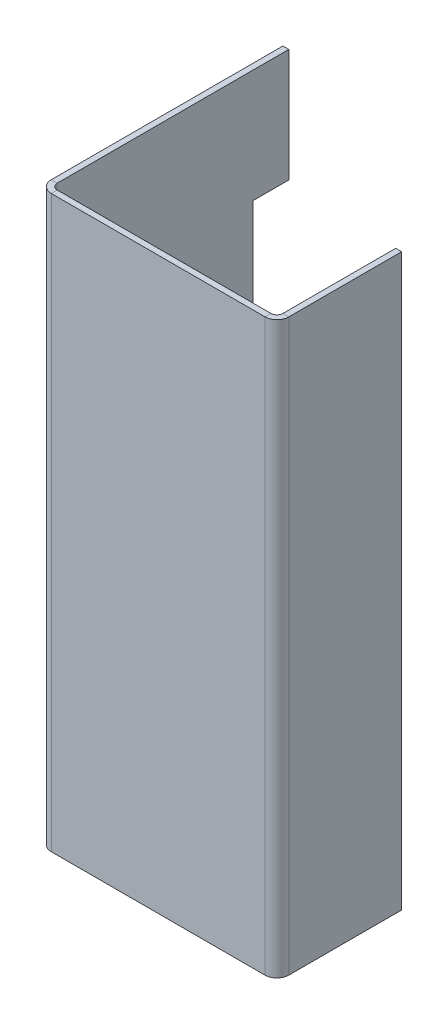
ISO-10303-21;
HEADER;
FILE_DESCRIPTION(('STEP AP214'),'2;1');
FILE_NAME('part.step','',(''),(''),'','','');
FILE_SCHEMA(('AUTOMOTIVE_DESIGN { 1 0 10303 214 1 1 1 1 }'));
ENDSEC;
DATA;
#1=APPLICATION_CONTEXT('core data for automotive mechanical design processes');
#2=APPLICATION_PROTOCOL_DEFINITION('international standard','automotive_design',2000,#1);
#3=PRODUCT_CONTEXT('',#1,'mechanical');
#4=PRODUCT('Part','Part','',(#3));
#5=PRODUCT_RELATED_PRODUCT_CATEGORY('part','',(#4));
#6=PRODUCT_DEFINITION_FORMATION('','',#4);
#7=PRODUCT_DEFINITION_CONTEXT('part definition',#1,'design');
#8=PRODUCT_DEFINITION('design','',#6,#7);
#9=PRODUCT_DEFINITION_SHAPE('','',#8);
#10=(LENGTH_UNIT() NAMED_UNIT(*) SI_UNIT(.MILLI.,.METRE.));
#11=(NAMED_UNIT(*) PLANE_ANGLE_UNIT() SI_UNIT($,.RADIAN.));
#12=(NAMED_UNIT(*) SI_UNIT($,.STERADIAN.) SOLID_ANGLE_UNIT());
#13=UNCERTAINTY_MEASURE_WITH_UNIT(LENGTH_MEASURE(1.E-05),#10,'distance_accuracy_value','');
#14=(GEOMETRIC_REPRESENTATION_CONTEXT(3) GLOBAL_UNCERTAINTY_ASSIGNED_CONTEXT((#13)) GLOBAL_UNIT_ASSIGNED_CONTEXT((#10,
#11,#12)) REPRESENTATION_CONTEXT('',''));
#15=CARTESIAN_POINT('',(0.,0.,0.));
#16=DIRECTION('',(0.,0.,1.));
#17=DIRECTION('',(1.,0.,0.));
#18=AXIS2_PLACEMENT_3D('',#15,#16,#17);
#19=CARTESIAN_POINT('',(-31.7500000000002,76.1999999999999,-65.0875));
#20=DIRECTION('',(0.,0.,-1.));
#21=DIRECTION('',(-1.,0.,0.));
#22=AXIS2_PLACEMENT_3D('',#19,#20,#21);
#23=PLANE('',#22);
#24=DIRECTION('',(1.,0.,0.));
#25=VECTOR('',#24,1.);
#26=CARTESIAN_POINT('',(-31.7500000000004,-36.5760000000001,-65.0875));
#27=LINE('',#26,#25);
#28=CARTESIAN_POINT('',(-31.7500000000004,-36.5760000000001,-65.0875));
#29=VERTEX_POINT('',#28);
#30=CARTESIAN_POINT('',(-30.1625000000002,-36.5760000000001,-65.0875));
#31=VERTEX_POINT('',#30);
#32=EDGE_CURVE('E235',#29,#31,#27,.T.);
#33=ORIENTED_EDGE('',*,*,#32,.T.);
#34=DIRECTION('',(0.,-1.,0.));
#35=VECTOR('',#34,1.);
#36=CARTESIAN_POINT('',(-30.1625000000002,0.,-65.0875));
#37=LINE('',#36,#35);
#38=CARTESIAN_POINT('',(-30.1625000000002,-76.2,-65.0875));
#39=VERTEX_POINT('',#38);
#40=EDGE_CURVE('E277',#39,#31,#37,.F.);
#41=ORIENTED_EDGE('',*,*,#40,.F.);
#42=DIRECTION('',(1.,0.,0.));
#43=VECTOR('',#42,1.);
#44=CARTESIAN_POINT('',(-31.7500000000002,-76.2,-65.0875));
#45=LINE('',#44,#43);
#46=CARTESIAN_POINT('',(-31.7500000000002,-76.2,-65.0875));
#47=VERTEX_POINT('',#46);
#48=EDGE_CURVE('E263',#47,#39,#45,.T.);
#49=ORIENTED_EDGE('',*,*,#48,.F.);
#50=DIRECTION('',(0.,1.,0.));
#51=VECTOR('',#50,1.);
#52=CARTESIAN_POINT('',(-31.7500000000002,76.1999999999999,-65.0875));
#53=LINE('',#52,#51);
#54=EDGE_CURVE('E269',#47,#29,#53,.T.);
#55=ORIENTED_EDGE('',*,*,#54,.T.);
#56=EDGE_LOOP('',(#33,#41,#49,#55));
#57=FACE_BOUND('',#56,.T.);
#58=ADVANCED_FACE('F89',(#57),#23,.T.);
#59=CARTESIAN_POINT('',(-30.1625,0.,1.11022302462516E-13));
#60=DIRECTION('',(-1.,0.,0.));
#61=DIRECTION('',(0.,0.,1.));
#62=AXIS2_PLACEMENT_3D('',#59,#60,#61);
#63=PLANE('',#62);
#64=CARTESIAN_POINT('',(-30.1625,0.,-9.52500000000001));
#65=DIRECTION('',(-1.,0.,0.));
#66=DIRECTION('',(0.,0.,1.));
#67=AXIS2_PLACEMENT_3D('',#64,#65,#66);
#68=CIRCLE('',#67,1.63194999999999);
#69=CARTESIAN_POINT('',(-30.1625,0.,-7.89305000000001));
#70=VERTEX_POINT('',#69);
#71=EDGE_CURVE('E247',#70,#70,#68,.F.);
#72=ORIENTED_EDGE('',*,*,#71,.F.);
#73=EDGE_LOOP('',(#72));
#74=FACE_BOUND('',#73,.T.);
#75=CARTESIAN_POINT('',(-30.1625,50.8,-9.52500000000001));
#76=DIRECTION('',(-1.,0.,0.));
#77=DIRECTION('',(0.,0.,1.));
#78=AXIS2_PLACEMENT_3D('',#75,#76,#77);
#79=CIRCLE('',#78,1.63194999999999);
#80=CARTESIAN_POINT('',(-30.1625,50.8,-7.89305000000002));
#81=VERTEX_POINT('',#80);
#82=EDGE_CURVE('E253',#81,#81,#79,.F.);
#83=ORIENTED_EDGE('',*,*,#82,.F.);
#84=EDGE_LOOP('',(#83));
#85=FACE_BOUND('',#84,.T.);
#86=ORIENTED_EDGE('',*,*,#40,.T.);
#87=DIRECTION('',(0.,0.,-1.));
#88=VECTOR('',#87,1.);
#89=CARTESIAN_POINT('',(-30.1625000000002,-36.5760000000001,-65.0875));
#90=LINE('',#89,#88);
#91=CARTESIAN_POINT('',(-30.1625000000002,-36.5760000000001,-55.5625));
#92=VERTEX_POINT('',#91);
#93=EDGE_CURVE('E227',#92,#31,#90,.T.);
#94=ORIENTED_EDGE('',*,*,#93,.F.);
#95=DIRECTION('',(0.,-1.,0.));
#96=VECTOR('',#95,1.);
#97=CARTESIAN_POINT('',(-30.1625000000002,45.9739999999999,-55.5625));
#98=LINE('',#97,#96);
#99=CARTESIAN_POINT('',(-30.1625000000002,45.9739999999999,-55.5625));
#100=VERTEX_POINT('',#99);
#101=EDGE_CURVE('E229',#100,#92,#98,.T.);
#102=ORIENTED_EDGE('',*,*,#101,.F.);
#103=DIRECTION('',(0.,0.,1.));
#104=VECTOR('',#103,1.);
#105=CARTESIAN_POINT('',(-30.1625000000002,45.9739999999999,-65.0875));
#106=LINE('',#105,#104);
#107=CARTESIAN_POINT('',(-30.1625000000002,45.9739999999999,-65.0875));
#108=VERTEX_POINT('',#107);
#109=EDGE_CURVE('E207',#108,#100,#106,.T.);
#110=ORIENTED_EDGE('',*,*,#109,.F.);
#111=CARTESIAN_POINT('',(-30.1625000000002,76.1999999999999,-65.0875));
#112=VERTEX_POINT('',#111);
#113=EDGE_CURVE('E280',#108,#112,#37,.F.);
#114=ORIENTED_EDGE('',*,*,#113,.T.);
#115=DIRECTION('',(0.,0.,-1.));
#116=VECTOR('',#115,1.);
#117=CARTESIAN_POINT('',(-30.1625,76.2,0.));
#118=LINE('',#117,#116);
#119=CARTESIAN_POINT('',(-30.1625,76.2,-3.17500000000001));
#120=VERTEX_POINT('',#119);
#121=EDGE_CURVE('E274',#112,#120,#118,.F.);
#122=ORIENTED_EDGE('',*,*,#121,.T.);
#123=DIRECTION('',(0.,-1.,0.));
#124=VECTOR('',#123,1.);
#125=CARTESIAN_POINT('',(-30.1625,-76.2,-3.17499999999999));
#126=LINE('',#125,#124);
#127=CARTESIAN_POINT('',(-30.1625,-76.2,-3.17499999999999));
#128=VERTEX_POINT('',#127);
#129=EDGE_CURVE('E289',#128,#120,#126,.F.);
#130=ORIENTED_EDGE('',*,*,#129,.F.);
#131=DIRECTION('',(0.,0.,1.));
#132=VECTOR('',#131,1.);
#133=CARTESIAN_POINT('',(-30.1625,-76.2,1.27675647831893E-13));
#134=LINE('',#133,#132);
#135=EDGE_CURVE('E281',#128,#39,#134,.F.);
#136=ORIENTED_EDGE('',*,*,#135,.T.);
#137=EDGE_LOOP('',(#86,#94,#102,#110,#114,#122,#130,#136));
#138=FACE_BOUND('',#137,.T.);
#139=CARTESIAN_POINT('',(-30.1625,-50.8,-9.52500000000001));
#140=DIRECTION('',(-1.,0.,0.));
#141=DIRECTION('',(0.,0.,1.));
#142=AXIS2_PLACEMENT_3D('',#139,#140,#141);
#143=CIRCLE('',#142,1.63194999999999);
#144=CARTESIAN_POINT('',(-30.1625,-50.8,-7.89305000000002));
#145=VERTEX_POINT('',#144);
#146=EDGE_CURVE('E241',#145,#145,#143,.F.);
#147=ORIENTED_EDGE('',*,*,#146,.F.);
#148=EDGE_LOOP('',(#147));
#149=FACE_BOUND('',#148,.T.);
#150=ADVANCED_FACE('F420',(#74,#85,#138,#149),#63,.F.);
#151=CARTESIAN_POINT('',(0.,0.,-1.5875));
#152=DIRECTION('',(0.,0.,-1.));
#153=DIRECTION('',(-1.,0.,0.));
#154=AXIS2_PLACEMENT_3D('',#151,#152,#153);
#155=PLANE('',#154);
#156=DIRECTION('',(1.,0.,0.));
#157=VECTOR('',#156,1.);
#158=CARTESIAN_POINT('',(-31.75,-76.2,-1.5875));
#159=LINE('',#158,#157);
#160=CARTESIAN_POINT('',(-28.575,-76.2,-1.58749999999999));
#161=VERTEX_POINT('',#160);
#162=CARTESIAN_POINT('',(28.575,-76.2,-1.5875));
#163=VERTEX_POINT('',#162);
#164=EDGE_CURVE('E15',#161,#163,#159,.T.);
#165=ORIENTED_EDGE('',*,*,#164,.F.);
#166=DIRECTION('',(0.,1.,0.));
#167=VECTOR('',#166,1.);
#168=CARTESIAN_POINT('',(-28.575,76.2,-1.58750000000001));
#169=LINE('',#168,#167);
#170=CARTESIAN_POINT('',(-28.575,76.2,-1.58750000000001));
#171=VERTEX_POINT('',#170);
#172=EDGE_CURVE('E305',#171,#161,#169,.F.);
#173=ORIENTED_EDGE('',*,*,#172,.F.);
#174=DIRECTION('',(-1.,0.,0.));
#175=VECTOR('',#174,1.);
#176=CARTESIAN_POINT('',(-31.75,76.2,-1.5875));
#177=LINE('',#176,#175);
#178=CARTESIAN_POINT('',(28.575,76.2,-1.5875));
#179=VERTEX_POINT('',#178);
#180=EDGE_CURVE('E98',#179,#171,#177,.T.);
#181=ORIENTED_EDGE('',*,*,#180,.F.);
#182=DIRECTION('',(0.,-1.,0.));
#183=VECTOR('',#182,1.);
#184=CARTESIAN_POINT('',(28.575,-76.2,-1.58750000000001));
#185=LINE('',#184,#183);
#186=EDGE_CURVE('E360',#163,#179,#185,.F.);
#187=ORIENTED_EDGE('',*,*,#186,.F.);
#188=EDGE_LOOP('',(#165,#173,#181,#187));
#189=FACE_BOUND('',#188,.T.);
#190=ADVANCED_FACE('F427',(#189),#155,.T.);
#191=CARTESIAN_POINT('',(0.,0.,0.));
#192=DIRECTION('',(0.,0.,-1.));
#193=DIRECTION('',(-1.,0.,0.));
#194=AXIS2_PLACEMENT_3D('',#191,#192,#193);
#195=PLANE('',#194);
#196=DIRECTION('',(0.,1.,0.));
#197=VECTOR('',#196,1.);
#198=CARTESIAN_POINT('',(-28.575,76.2,0.));
#199=LINE('',#198,#197);
#200=CARTESIAN_POINT('',(-28.575,76.2,0.));
#201=VERTEX_POINT('',#200);
#202=CARTESIAN_POINT('',(-28.575,-76.2,0.));
#203=VERTEX_POINT('',#202);
#204=EDGE_CURVE('E293',#201,#203,#199,.F.);
#205=ORIENTED_EDGE('',*,*,#204,.T.);
#206=DIRECTION('',(1.,0.,0.));
#207=VECTOR('',#206,1.);
#208=CARTESIAN_POINT('',(-31.75,-76.2,0.));
#209=LINE('',#208,#207);
#210=CARTESIAN_POINT('',(28.575,-76.2,0.));
#211=VERTEX_POINT('',#210);
#212=EDGE_CURVE('E93',#203,#211,#209,.T.);
#213=ORIENTED_EDGE('',*,*,#212,.T.);
#214=DIRECTION('',(0.,-1.,0.));
#215=VECTOR('',#214,1.);
#216=CARTESIAN_POINT('',(28.575,-76.2,0.));
#217=LINE('',#216,#215);
#218=CARTESIAN_POINT('',(28.575,76.2,0.));
#219=VERTEX_POINT('',#218);
#220=EDGE_CURVE('E348',#211,#219,#217,.F.);
#221=ORIENTED_EDGE('',*,*,#220,.T.);
#222=DIRECTION('',(-1.,0.,0.));
#223=VECTOR('',#222,1.);
#224=CARTESIAN_POINT('',(-31.75,76.2,0.));
#225=LINE('',#224,#223);
#226=EDGE_CURVE('E366',#219,#201,#225,.T.);
#227=ORIENTED_EDGE('',*,*,#226,.T.);
#228=EDGE_LOOP('',(#205,#213,#221,#227));
#229=FACE_BOUND('',#228,.T.);
#230=ADVANCED_FACE('F371',(#229),#195,.F.);
#231=CARTESIAN_POINT('',(-31.75,76.2,-1.5875));
#232=DIRECTION('',(0.,1.,0.));
#233=DIRECTION('',(0.,0.,1.));
#234=AXIS2_PLACEMENT_3D('',#231,#232,#233);
#235=PLANE('',#234);
#236=ORIENTED_EDGE('',*,*,#180,.T.);
#237=DIRECTION('',(0.,0.,1.));
#238=VECTOR('',#237,1.);
#239=CARTESIAN_POINT('',(-28.575,76.2,-1.58750000000001));
#240=LINE('',#239,#238);
#241=EDGE_CURVE('E299',#171,#201,#240,.T.);
#242=ORIENTED_EDGE('',*,*,#241,.T.);
#243=ORIENTED_EDGE('',*,*,#226,.F.);
#244=DIRECTION('',(0.,0.,1.));
#245=VECTOR('',#244,1.);
#246=CARTESIAN_POINT('',(28.575,76.2,-1.58749999999999));
#247=LINE('',#246,#245);
#248=EDGE_CURVE('E114',#179,#219,#247,.T.);
#249=ORIENTED_EDGE('',*,*,#248,.F.);
#250=EDGE_LOOP('',(#236,#242,#243,#249));
#251=FACE_BOUND('',#250,.T.);
#252=ADVANCED_FACE('F91',(#251),#235,.T.);
#253=CARTESIAN_POINT('',(-31.75,-76.2,-1.5875));
#254=DIRECTION('',(0.,-1.,0.));
#255=DIRECTION('',(0.,0.,-1.));
#256=AXIS2_PLACEMENT_3D('',#253,#254,#255);
#257=PLANE('',#256);
#258=DIRECTION('',(0.,0.,1.));
#259=VECTOR('',#258,1.);
#260=CARTESIAN_POINT('',(-28.575,-76.2,-1.58749999999999));
#261=LINE('',#260,#259);
#262=EDGE_CURVE('E310',#161,#203,#261,.T.);
#263=ORIENTED_EDGE('',*,*,#262,.F.);
#264=ORIENTED_EDGE('',*,*,#164,.T.);
#265=DIRECTION('',(0.,0.,1.));
#266=VECTOR('',#265,1.);
#267=CARTESIAN_POINT('',(28.575,-76.2,-1.58750000000001));
#268=LINE('',#267,#266);
#269=EDGE_CURVE('E354',#163,#211,#268,.T.);
#270=ORIENTED_EDGE('',*,*,#269,.T.);
#271=ORIENTED_EDGE('',*,*,#212,.F.);
#272=EDGE_LOOP('',(#263,#264,#270,#271));
#273=FACE_BOUND('',#272,.T.);
#274=ADVANCED_FACE('F376',(#273),#257,.T.);
#275=CARTESIAN_POINT('',(28.575,76.2,-3.17499999999999));
#276=DIRECTION('',(0.,1.,0.));
#277=DIRECTION('',(0.,0.,1.));
#278=AXIS2_PLACEMENT_3D('',#275,#276,#277);
#279=PLANE('',#278);
#280=DIRECTION('',(1.,0.,0.));
#281=VECTOR('',#280,1.);
#282=CARTESIAN_POINT('',(31.75,76.2,-3.17499999999999));
#283=LINE('',#282,#281);
#284=CARTESIAN_POINT('',(30.1625,76.2,-3.17499999999999));
#285=VERTEX_POINT('',#284);
#286=CARTESIAN_POINT('',(31.75,76.2,-3.17499999999998));
#287=VERTEX_POINT('',#286);
#288=EDGE_CURVE('E313',#285,#287,#283,.T.);
#289=ORIENTED_EDGE('',*,*,#288,.F.);
#290=CARTESIAN_POINT('',(28.575,76.2,-3.17499999999999));
#291=DIRECTION('',(0.,-1.,0.));
#292=DIRECTION('',(0.,0.,-1.));
#293=AXIS2_PLACEMENT_3D('',#290,#291,#292);
#294=CIRCLE('',#293,1.5875);
#295=EDGE_CURVE('E357',#179,#285,#294,.F.);
#296=ORIENTED_EDGE('',*,*,#295,.F.);
#297=ORIENTED_EDGE('',*,*,#248,.T.);
#298=CARTESIAN_POINT('',(28.575,76.2,-3.17499999999999));
#299=DIRECTION('',(0.,-1.,0.));
#300=DIRECTION('',(0.,0.,-1.));
#301=AXIS2_PLACEMENT_3D('',#298,#299,#300);
#302=CIRCLE('',#301,3.175);
#303=EDGE_CURVE('E350',#219,#287,#302,.F.);
#304=ORIENTED_EDGE('',*,*,#303,.T.);
#305=EDGE_LOOP('',(#289,#296,#297,#304));
#306=FACE_BOUND('',#305,.T.);
#307=ADVANCED_FACE('F403',(#306),#279,.T.);
#308=CARTESIAN_POINT('',(28.575,-76.2,-3.17500000000001));
#309=DIRECTION('',(0.,1.,0.));
#310=DIRECTION('',(0.,0.,1.));
#311=AXIS2_PLACEMENT_3D('',#308,#309,#310);
#312=PLANE('',#311);
#313=CARTESIAN_POINT('',(28.575,-76.2,-3.17500000000001));
#314=DIRECTION('',(0.,-1.,0.));
#315=DIRECTION('',(0.,0.,-1.));
#316=AXIS2_PLACEMENT_3D('',#313,#314,#315);
#317=CIRCLE('',#316,1.5875);
#318=CARTESIAN_POINT('',(30.1625,-76.2,-3.17500000000001));
#319=VERTEX_POINT('',#318);
#320=EDGE_CURVE('E318',#319,#163,#317,.T.);
#321=ORIENTED_EDGE('',*,*,#320,.F.);
#322=DIRECTION('',(1.,0.,0.));
#323=VECTOR('',#322,1.);
#324=CARTESIAN_POINT('',(30.1625,-76.2,-3.175));
#325=LINE('',#324,#323);
#326=CARTESIAN_POINT('',(31.75,-76.2,-3.175));
#327=VERTEX_POINT('',#326);
#328=EDGE_CURVE('E341',#319,#327,#325,.T.);
#329=ORIENTED_EDGE('',*,*,#328,.T.);
#330=CARTESIAN_POINT('',(28.575,-76.2,-3.17500000000001));
#331=DIRECTION('',(0.,-1.,0.));
#332=DIRECTION('',(0.,0.,-1.));
#333=AXIS2_PLACEMENT_3D('',#330,#331,#332);
#334=CIRCLE('',#333,3.175);
#335=EDGE_CURVE('E351',#327,#211,#334,.T.);
#336=ORIENTED_EDGE('',*,*,#335,.T.);
#337=ORIENTED_EDGE('',*,*,#269,.F.);
#338=EDGE_LOOP('',(#321,#329,#336,#337));
#339=FACE_BOUND('',#338,.T.);
#340=ADVANCED_FACE('F384',(#339),#312,.F.);
#341=CARTESIAN_POINT('',(28.575,-76.2,-3.17500000000001));
#342=DIRECTION('',(0.,-1.,0.));
#343=DIRECTION('',(1.,0.,0.));
#344=AXIS2_PLACEMENT_3D('',#341,#342,#343);
#345=CYLINDRICAL_SURFACE('',#344,3.175);
#346=ORIENTED_EDGE('',*,*,#220,.F.);
#347=ORIENTED_EDGE('',*,*,#335,.F.);
#348=DIRECTION('',(0.,-1.,0.));
#349=VECTOR('',#348,1.);
#350=CARTESIAN_POINT('',(31.75,0.,-3.17499999999999));
#351=LINE('',#350,#349);
#352=EDGE_CURVE('E338',#287,#327,#351,.T.);
#353=ORIENTED_EDGE('',*,*,#352,.F.);
#354=ORIENTED_EDGE('',*,*,#303,.F.);
#355=EDGE_LOOP('',(#346,#347,#353,#354));
#356=FACE_BOUND('',#355,.T.);
#357=ADVANCED_FACE('F383',(#356),#345,.T.);
#358=CARTESIAN_POINT('',(28.575,-76.2,-3.17500000000001));
#359=DIRECTION('',(0.,-1.,0.));
#360=DIRECTION('',(1.,0.,0.));
#361=AXIS2_PLACEMENT_3D('',#358,#359,#360);
#362=CYLINDRICAL_SURFACE('',#361,1.5875);
#363=ORIENTED_EDGE('',*,*,#186,.T.);
#364=ORIENTED_EDGE('',*,*,#295,.T.);
#365=DIRECTION('',(0.,1.,0.));
#366=VECTOR('',#365,1.);
#367=CARTESIAN_POINT('',(30.1625,76.2,-3.17499999999999));
#368=LINE('',#367,#366);
#369=EDGE_CURVE('E344',#285,#319,#368,.F.);
#370=ORIENTED_EDGE('',*,*,#369,.T.);
#371=ORIENTED_EDGE('',*,*,#320,.T.);
#372=EDGE_LOOP('',(#363,#364,#370,#371));
#373=FACE_BOUND('',#372,.T.);
#374=ADVANCED_FACE('F406',(#373),#362,.F.);
#375=CARTESIAN_POINT('',(31.75,-76.2,-1.58749999999999));
#376=DIRECTION('',(0.,-1.,0.));
#377=DIRECTION('',(0.,0.,-1.));
#378=AXIS2_PLACEMENT_3D('',#375,#376,#377);
#379=PLANE('',#378);
#380=DIRECTION('',(0.,0.,1.));
#381=VECTOR('',#380,1.);
#382=CARTESIAN_POINT('',(31.75,-76.2,-1.58749999999999));
#383=LINE('',#382,#381);
#384=CARTESIAN_POINT('',(31.7500000000001,-76.2,-33.3375));
#385=VERTEX_POINT('',#384);
#386=EDGE_CURVE('E322',#385,#327,#383,.T.);
#387=ORIENTED_EDGE('',*,*,#386,.T.);
#388=ORIENTED_EDGE('',*,*,#328,.F.);
#389=DIRECTION('',(0.,0.,-1.));
#390=VECTOR('',#389,1.);
#391=CARTESIAN_POINT('',(30.1625,-76.2,0.));
#392=LINE('',#391,#390);
#393=CARTESIAN_POINT('',(30.1625000000001,-76.2,-33.3375));
#394=VERTEX_POINT('',#393);
#395=EDGE_CURVE('E330',#394,#319,#392,.F.);
#396=ORIENTED_EDGE('',*,*,#395,.F.);
#397=DIRECTION('',(-1.,0.,0.));
#398=VECTOR('',#397,1.);
#399=CARTESIAN_POINT('',(31.7500000000001,-76.2,-33.3375));
#400=LINE('',#399,#398);
#401=EDGE_CURVE('E316',#385,#394,#400,.T.);
#402=ORIENTED_EDGE('',*,*,#401,.F.);
#403=EDGE_LOOP('',(#387,#388,#396,#402));
#404=FACE_BOUND('',#403,.T.);
#405=ADVANCED_FACE('F393',(#404),#379,.T.);
#406=CARTESIAN_POINT('',(31.7500000000001,76.2,-33.3375));
#407=DIRECTION('',(0.,1.,0.));
#408=DIRECTION('',(0.,0.,1.));
#409=AXIS2_PLACEMENT_3D('',#406,#407,#408);
#410=PLANE('',#409);
#411=DIRECTION('',(0.,0.,1.));
#412=VECTOR('',#411,1.);
#413=CARTESIAN_POINT('',(30.1625,76.2,1.4432899320127E-13));
#414=LINE('',#413,#412);
#415=CARTESIAN_POINT('',(30.1625000000001,76.2,-33.3375));
#416=VERTEX_POINT('',#415);
#417=EDGE_CURVE('E336',#285,#416,#414,.F.);
#418=ORIENTED_EDGE('',*,*,#417,.F.);
#419=ORIENTED_EDGE('',*,*,#288,.T.);
#420=DIRECTION('',(0.,0.,-1.));
#421=VECTOR('',#420,1.);
#422=CARTESIAN_POINT('',(31.7500000000001,76.2,-33.3375));
#423=LINE('',#422,#421);
#424=CARTESIAN_POINT('',(31.7500000000001,76.2,-33.3375));
#425=VERTEX_POINT('',#424);
#426=EDGE_CURVE('E328',#287,#425,#423,.T.);
#427=ORIENTED_EDGE('',*,*,#426,.T.);
#428=DIRECTION('',(-1.,0.,0.));
#429=VECTOR('',#428,1.);
#430=CARTESIAN_POINT('',(31.7500000000001,76.2,-33.3375));
#431=LINE('',#430,#429);
#432=EDGE_CURVE('E319',#425,#416,#431,.T.);
#433=ORIENTED_EDGE('',*,*,#432,.T.);
#434=EDGE_LOOP('',(#418,#419,#427,#433));
#435=FACE_BOUND('',#434,.T.);
#436=ADVANCED_FACE('F400',(#435),#410,.T.);
#437=CARTESIAN_POINT('',(31.75,0.,1.16565029087929E-13));
#438=DIRECTION('',(1.,0.,0.));
#439=DIRECTION('',(0.,0.,-1.));
#440=AXIS2_PLACEMENT_3D('',#437,#438,#439);
#441=PLANE('',#440);
#442=ORIENTED_EDGE('',*,*,#426,.F.);
#443=ORIENTED_EDGE('',*,*,#352,.T.);
#444=ORIENTED_EDGE('',*,*,#386,.F.);
#445=DIRECTION('',(0.,-1.,0.));
#446=VECTOR('',#445,1.);
#447=CARTESIAN_POINT('',(31.7500000000001,-76.2,-33.3375));
#448=LINE('',#447,#446);
#449=EDGE_CURVE('E325',#425,#385,#448,.T.);
#450=ORIENTED_EDGE('',*,*,#449,.F.);
#451=EDGE_LOOP('',(#442,#443,#444,#450));
#452=FACE_BOUND('',#451,.T.);
#453=ADVANCED_FACE('F391',(#452),#441,.T.);
#454=CARTESIAN_POINT('',(30.1625,0.,1.11022302462516E-13));
#455=DIRECTION('',(1.,0.,0.));
#456=DIRECTION('',(0.,0.,-1.));
#457=AXIS2_PLACEMENT_3D('',#454,#455,#456);
#458=PLANE('',#457);
#459=ORIENTED_EDGE('',*,*,#369,.F.);
#460=ORIENTED_EDGE('',*,*,#417,.T.);
#461=DIRECTION('',(0.,1.,0.));
#462=VECTOR('',#461,1.);
#463=CARTESIAN_POINT('',(30.1625000000001,0.,-33.3375));
#464=LINE('',#463,#462);
#465=EDGE_CURVE('E333',#416,#394,#464,.F.);
#466=ORIENTED_EDGE('',*,*,#465,.T.);
#467=ORIENTED_EDGE('',*,*,#395,.T.);
#468=EDGE_LOOP('',(#459,#460,#466,#467));
#469=FACE_BOUND('',#468,.T.);
#470=ADVANCED_FACE('F408',(#469),#458,.F.);
#471=CARTESIAN_POINT('',(31.7500000000001,-76.2,-33.3375));
#472=DIRECTION('',(0.,0.,-1.));
#473=DIRECTION('',(-1.,0.,0.));
#474=AXIS2_PLACEMENT_3D('',#471,#472,#473);
#475=PLANE('',#474);
#476=ORIENTED_EDGE('',*,*,#465,.F.);
#477=ORIENTED_EDGE('',*,*,#432,.F.);
#478=ORIENTED_EDGE('',*,*,#449,.T.);
#479=ORIENTED_EDGE('',*,*,#401,.T.);
#480=EDGE_LOOP('',(#476,#477,#478,#479));
#481=FACE_BOUND('',#480,.T.);
#482=ADVANCED_FACE('F397',(#481),#475,.T.);
#483=CARTESIAN_POINT('',(-28.575,-76.2,-3.17499999999999));
#484=DIRECTION('',(0.,-1.,0.));
#485=DIRECTION('',(0.,0.,-1.));
#486=AXIS2_PLACEMENT_3D('',#483,#484,#485);
#487=PLANE('',#486);
#488=DIRECTION('',(-1.,0.,0.));
#489=VECTOR('',#488,1.);
#490=CARTESIAN_POINT('',(-31.75,-76.2,-3.17499999999999));
#491=LINE('',#490,#489);
#492=CARTESIAN_POINT('',(-31.75,-76.2,-3.17499999999998));
#493=VERTEX_POINT('',#492);
#494=EDGE_CURVE('E256',#128,#493,#491,.T.);
#495=ORIENTED_EDGE('',*,*,#494,.F.);
#496=CARTESIAN_POINT('',(-28.575,-76.2,-3.17499999999999));
#497=DIRECTION('',(0.,1.,0.));
#498=DIRECTION('',(0.,0.,1.));
#499=AXIS2_PLACEMENT_3D('',#496,#497,#498);
#500=CIRCLE('',#499,1.5875);
#501=EDGE_CURVE('E302',#161,#128,#500,.F.);
#502=ORIENTED_EDGE('',*,*,#501,.F.);
#503=ORIENTED_EDGE('',*,*,#262,.T.);
#504=CARTESIAN_POINT('',(-28.575,-76.2,-3.17499999999999));
#505=DIRECTION('',(0.,1.,0.));
#506=DIRECTION('',(0.,0.,1.));
#507=AXIS2_PLACEMENT_3D('',#504,#505,#506);
#508=CIRCLE('',#507,3.175);
#509=EDGE_CURVE('E295',#203,#493,#508,.F.);
#510=ORIENTED_EDGE('',*,*,#509,.T.);
#511=EDGE_LOOP('',(#495,#502,#503,#510));
#512=FACE_BOUND('',#511,.T.);
#513=ADVANCED_FACE('F415',(#512),#487,.T.);
#514=CARTESIAN_POINT('',(-28.575,76.2,-3.17500000000001));
#515=DIRECTION('',(0.,-1.,0.));
#516=DIRECTION('',(0.,0.,-1.));
#517=AXIS2_PLACEMENT_3D('',#514,#515,#516);
#518=PLANE('',#517);
#519=CARTESIAN_POINT('',(-28.575,76.2,-3.17500000000001));
#520=DIRECTION('',(0.,1.,0.));
#521=DIRECTION('',(0.,0.,1.));
#522=AXIS2_PLACEMENT_3D('',#519,#520,#521);
#523=CIRCLE('',#522,1.5875);
#524=EDGE_CURVE('E262',#120,#171,#523,.T.);
#525=ORIENTED_EDGE('',*,*,#524,.F.);
#526=DIRECTION('',(-1.,0.,0.));
#527=VECTOR('',#526,1.);
#528=CARTESIAN_POINT('',(-30.1625,76.2,-3.175));
#529=LINE('',#528,#527);
#530=CARTESIAN_POINT('',(-31.75,76.2,-3.175));
#531=VERTEX_POINT('',#530);
#532=EDGE_CURVE('E286',#120,#531,#529,.T.);
#533=ORIENTED_EDGE('',*,*,#532,.T.);
#534=CARTESIAN_POINT('',(-28.575,76.2,-3.17500000000001));
#535=DIRECTION('',(0.,1.,0.));
#536=DIRECTION('',(0.,0.,1.));
#537=AXIS2_PLACEMENT_3D('',#534,#535,#536);
#538=CIRCLE('',#537,3.175);
#539=EDGE_CURVE('E296',#531,#201,#538,.T.);
#540=ORIENTED_EDGE('',*,*,#539,.T.);
#541=ORIENTED_EDGE('',*,*,#241,.F.);
#542=EDGE_LOOP('',(#525,#533,#540,#541));
#543=FACE_BOUND('',#542,.T.);
#544=ADVANCED_FACE('F469',(#543),#518,.F.);
#545=CARTESIAN_POINT('',(-28.575,76.2,-3.17500000000001));
#546=DIRECTION('',(0.,1.,0.));
#547=DIRECTION('',(-1.,0.,0.));
#548=AXIS2_PLACEMENT_3D('',#545,#546,#547);
#549=CYLINDRICAL_SURFACE('',#548,3.175);
#550=ORIENTED_EDGE('',*,*,#204,.F.);
#551=ORIENTED_EDGE('',*,*,#539,.F.);
#552=DIRECTION('',(0.,1.,0.));
#553=VECTOR('',#552,1.);
#554=CARTESIAN_POINT('',(-31.75,0.,-3.17499999999999));
#555=LINE('',#554,#553);
#556=EDGE_CURVE('E283',#493,#531,#555,.T.);
#557=ORIENTED_EDGE('',*,*,#556,.F.);
#558=ORIENTED_EDGE('',*,*,#509,.F.);
#559=EDGE_LOOP('',(#550,#551,#557,#558));
#560=FACE_BOUND('',#559,.T.);
#561=ADVANCED_FACE('F472',(#560),#549,.T.);
#562=CARTESIAN_POINT('',(-28.575,76.2,-3.17500000000001));
#563=DIRECTION('',(0.,1.,0.));
#564=DIRECTION('',(-1.,0.,0.));
#565=AXIS2_PLACEMENT_3D('',#562,#563,#564);
#566=CYLINDRICAL_SURFACE('',#565,1.5875);
#567=ORIENTED_EDGE('',*,*,#172,.T.);
#568=ORIENTED_EDGE('',*,*,#501,.T.);
#569=ORIENTED_EDGE('',*,*,#129,.T.);
#570=ORIENTED_EDGE('',*,*,#524,.T.);
#571=EDGE_LOOP('',(#567,#568,#569,#570));
#572=FACE_BOUND('',#571,.T.);
#573=ADVANCED_FACE('F462',(#572),#566,.F.);
#574=CARTESIAN_POINT('',(-31.75,76.2,-1.58749999999999));
#575=DIRECTION('',(0.,1.,0.));
#576=DIRECTION('',(0.,0.,1.));
#577=AXIS2_PLACEMENT_3D('',#574,#575,#576);
#578=PLANE('',#577);
#579=DIRECTION('',(0.,0.,1.));
#580=VECTOR('',#579,1.);
#581=CARTESIAN_POINT('',(-31.75,76.2,-1.58749999999999));
#582=LINE('',#581,#580);
#583=CARTESIAN_POINT('',(-31.7500000000002,76.1999999999999,-65.0875));
#584=VERTEX_POINT('',#583);
#585=EDGE_CURVE('E266',#584,#531,#582,.T.);
#586=ORIENTED_EDGE('',*,*,#585,.T.);
#587=ORIENTED_EDGE('',*,*,#532,.F.);
#588=ORIENTED_EDGE('',*,*,#121,.F.);
#589=DIRECTION('',(1.,0.,0.));
#590=VECTOR('',#589,1.);
#591=CARTESIAN_POINT('',(-31.7500000000002,76.1999999999999,-65.0875));
#592=LINE('',#591,#590);
#593=EDGE_CURVE('E259',#584,#112,#592,.T.);
#594=ORIENTED_EDGE('',*,*,#593,.F.);
#595=EDGE_LOOP('',(#586,#587,#588,#594));
#596=FACE_BOUND('',#595,.T.);
#597=ADVANCED_FACE('F467',(#596),#578,.T.);
#598=CARTESIAN_POINT('',(-31.7500000000002,-76.2,-65.0875));
#599=DIRECTION('',(0.,-1.,0.));
#600=DIRECTION('',(0.,0.,-1.));
#601=AXIS2_PLACEMENT_3D('',#598,#599,#600);
#602=PLANE('',#601);
#603=ORIENTED_EDGE('',*,*,#135,.F.);
#604=ORIENTED_EDGE('',*,*,#494,.T.);
#605=DIRECTION('',(0.,0.,-1.));
#606=VECTOR('',#605,1.);
#607=CARTESIAN_POINT('',(-31.7500000000002,-76.2,-65.0875));
#608=LINE('',#607,#606);
#609=EDGE_CURVE('E272',#493,#47,#608,.T.);
#610=ORIENTED_EDGE('',*,*,#609,.T.);
#611=ORIENTED_EDGE('',*,*,#48,.T.);
#612=EDGE_LOOP('',(#603,#604,#610,#611));
#613=FACE_BOUND('',#612,.T.);
#614=ADVANCED_FACE('F442',(#613),#602,.T.);
#615=CARTESIAN_POINT('',(-31.75,0.,1.16565029087929E-13));
#616=DIRECTION('',(-1.,0.,0.));
#617=DIRECTION('',(0.,0.,1.));
#618=AXIS2_PLACEMENT_3D('',#615,#616,#617);
#619=PLANE('',#618);
#620=DIRECTION('',(0.,0.,-1.));
#621=VECTOR('',#620,1.);
#622=CARTESIAN_POINT('',(-31.7500000000004,-36.5760000000001,-65.0875));
#623=LINE('',#622,#621);
#624=CARTESIAN_POINT('',(-31.7500000000004,-36.5760000000001,-55.5625));
#625=VERTEX_POINT('',#624);
#626=EDGE_CURVE('E220',#625,#29,#623,.T.);
#627=ORIENTED_EDGE('',*,*,#626,.T.);
#628=ORIENTED_EDGE('',*,*,#54,.F.);
#629=ORIENTED_EDGE('',*,*,#609,.F.);
#630=ORIENTED_EDGE('',*,*,#556,.T.);
#631=ORIENTED_EDGE('',*,*,#585,.F.);
#632=CARTESIAN_POINT('',(-31.7500000000002,45.9739999999999,-65.0875));
#633=VERTEX_POINT('',#632);
#634=EDGE_CURVE('E226',#633,#584,#53,.T.);
#635=ORIENTED_EDGE('',*,*,#634,.F.);
#636=DIRECTION('',(0.,0.,1.));
#637=VECTOR('',#636,1.);
#638=CARTESIAN_POINT('',(-31.7500000000004,45.9739999999999,-65.0875));
#639=LINE('',#638,#637);
#640=CARTESIAN_POINT('',(-31.7500000000004,45.9739999999999,-55.5625));
#641=VERTEX_POINT('',#640);
#642=EDGE_CURVE('E106',#633,#641,#639,.T.);
#643=ORIENTED_EDGE('',*,*,#642,.T.);
#644=DIRECTION('',(0.,-1.,0.));
#645=VECTOR('',#644,1.);
#646=CARTESIAN_POINT('',(-31.7500000000004,45.9739999999999,-55.5625));
#647=LINE('',#646,#645);
#648=EDGE_CURVE('E215',#641,#625,#647,.T.);
#649=ORIENTED_EDGE('',*,*,#648,.T.);
#650=EDGE_LOOP('',(#627,#628,#629,#630,#631,#635,#643,#649));
#651=FACE_BOUND('',#650,.T.);
#652=CARTESIAN_POINT('',(-31.75,-50.8,-9.525));
#653=DIRECTION('',(-1.,0.,0.));
#654=DIRECTION('',(0.,0.,1.));
#655=AXIS2_PLACEMENT_3D('',#652,#653,#654);
#656=CIRCLE('',#655,1.63194999999999);
#657=CARTESIAN_POINT('',(-31.75,-50.8,-7.89305000000002));
#658=VERTEX_POINT('',#657);
#659=EDGE_CURVE('E238',#658,#658,#656,.T.);
#660=ORIENTED_EDGE('',*,*,#659,.F.);
#661=EDGE_LOOP('',(#660));
#662=FACE_BOUND('',#661,.T.);
#663=CARTESIAN_POINT('',(-31.75,0.,-9.525));
#664=DIRECTION('',(-1.,0.,0.));
#665=DIRECTION('',(0.,0.,1.));
#666=AXIS2_PLACEMENT_3D('',#663,#664,#665);
#667=CIRCLE('',#666,1.63194999999999);
#668=CARTESIAN_POINT('',(-31.75,0.,-7.89305000000001));
#669=VERTEX_POINT('',#668);
#670=EDGE_CURVE('E244',#669,#669,#667,.T.);
#671=ORIENTED_EDGE('',*,*,#670,.F.);
#672=EDGE_LOOP('',(#671));
#673=FACE_BOUND('',#672,.T.);
#674=CARTESIAN_POINT('',(-31.75,50.8,-9.525));
#675=DIRECTION('',(-1.,0.,0.));
#676=DIRECTION('',(0.,0.,1.));
#677=AXIS2_PLACEMENT_3D('',#674,#675,#676);
#678=CIRCLE('',#677,1.63194999999999);
#679=CARTESIAN_POINT('',(-31.75,50.8,-7.89305000000002));
#680=VERTEX_POINT('',#679);
#681=EDGE_CURVE('E250',#680,#680,#678,.T.);
#682=ORIENTED_EDGE('',*,*,#681,.F.);
#683=EDGE_LOOP('',(#682));
#684=FACE_BOUND('',#683,.T.);
#685=ADVANCED_FACE('F223',(#651,#662,#673,#684),#619,.T.);
#686=DIRECTION('',(1.,0.,0.));
#687=VECTOR('',#686,1.);
#688=CARTESIAN_POINT('',(-31.7500000000004,45.9739999999999,-65.0875));
#689=LINE('',#688,#687);
#690=EDGE_CURVE('E212',#633,#108,#689,.T.);
#691=ORIENTED_EDGE('',*,*,#690,.F.);
#692=ORIENTED_EDGE('',*,*,#634,.T.);
#693=ORIENTED_EDGE('',*,*,#593,.T.);
#694=ORIENTED_EDGE('',*,*,#113,.F.);
#695=EDGE_LOOP('',(#691,#692,#693,#694));
#696=FACE_BOUND('',#695,.T.);
#697=ADVANCED_FACE('F423',(#696),#23,.T.);
#698=CARTESIAN_POINT('',(-31.75,50.8,-9.525));
#699=DIRECTION('',(-1.,0.,0.));
#700=DIRECTION('',(0.,0.,1.));
#701=AXIS2_PLACEMENT_3D('',#698,#699,#700);
#702=CYLINDRICAL_SURFACE('',#701,1.63194999999999);
#703=ORIENTED_EDGE('',*,*,#82,.T.);
#704=EDGE_LOOP('',(#703));
#705=FACE_BOUND('',#704,.T.);
#706=ORIENTED_EDGE('',*,*,#681,.T.);
#707=EDGE_LOOP('',(#706));
#708=FACE_BOUND('',#707,.T.);
#709=ADVANCED_FACE('F433',(#705,#708),#702,.F.);
#710=CARTESIAN_POINT('',(-31.75,0.,-9.525));
#711=DIRECTION('',(-1.,0.,0.));
#712=DIRECTION('',(0.,0.,1.));
#713=AXIS2_PLACEMENT_3D('',#710,#711,#712);
#714=CYLINDRICAL_SURFACE('',#713,1.63194999999999);
#715=ORIENTED_EDGE('',*,*,#71,.T.);
#716=EDGE_LOOP('',(#715));
#717=FACE_BOUND('',#716,.T.);
#718=ORIENTED_EDGE('',*,*,#670,.T.);
#719=EDGE_LOOP('',(#718));
#720=FACE_BOUND('',#719,.T.);
#721=ADVANCED_FACE('F439',(#717,#720),#714,.F.);
#722=CARTESIAN_POINT('',(-31.75,-50.8,-9.525));
#723=DIRECTION('',(-1.,0.,0.));
#724=DIRECTION('',(0.,0.,1.));
#725=AXIS2_PLACEMENT_3D('',#722,#723,#724);
#726=CYLINDRICAL_SURFACE('',#725,1.63194999999999);
#727=ORIENTED_EDGE('',*,*,#146,.T.);
#728=EDGE_LOOP('',(#727));
#729=FACE_BOUND('',#728,.T.);
#730=ORIENTED_EDGE('',*,*,#659,.T.);
#731=EDGE_LOOP('',(#730));
#732=FACE_BOUND('',#731,.T.);
#733=ADVANCED_FACE('F538',(#729,#732),#726,.F.);
#734=CARTESIAN_POINT('',(-31.7500000000004,-36.5760000000001,-65.0875));
#735=DIRECTION('',(0.,-1.,0.));
#736=DIRECTION('',(0.,0.,-1.));
#737=AXIS2_PLACEMENT_3D('',#734,#735,#736);
#738=PLANE('',#737);
#739=ORIENTED_EDGE('',*,*,#93,.T.);
#740=ORIENTED_EDGE('',*,*,#32,.F.);
#741=ORIENTED_EDGE('',*,*,#626,.F.);
#742=DIRECTION('',(1.,0.,0.));
#743=VECTOR('',#742,1.);
#744=CARTESIAN_POINT('',(-31.7500000000004,-36.5760000000001,-55.5625));
#745=LINE('',#744,#743);
#746=EDGE_CURVE('E211',#625,#92,#745,.T.);
#747=ORIENTED_EDGE('',*,*,#746,.T.);
#748=EDGE_LOOP('',(#739,#740,#741,#747));
#749=FACE_BOUND('',#748,.T.);
#750=ADVANCED_FACE('F451',(#749),#738,.F.);
#751=CARTESIAN_POINT('',(-31.7500000000004,45.9739999999999,-55.5625));
#752=DIRECTION('',(0.,0.,1.));
#753=DIRECTION('',(1.,0.,0.));
#754=AXIS2_PLACEMENT_3D('',#751,#752,#753);
#755=PLANE('',#754);
#756=ORIENTED_EDGE('',*,*,#101,.T.);
#757=ORIENTED_EDGE('',*,*,#746,.F.);
#758=ORIENTED_EDGE('',*,*,#648,.F.);
#759=DIRECTION('',(1.,0.,0.));
#760=VECTOR('',#759,1.);
#761=CARTESIAN_POINT('',(-31.7500000000004,45.9739999999999,-55.5625));
#762=LINE('',#761,#760);
#763=EDGE_CURVE('E203',#641,#100,#762,.T.);
#764=ORIENTED_EDGE('',*,*,#763,.T.);
#765=EDGE_LOOP('',(#756,#757,#758,#764));
#766=FACE_BOUND('',#765,.T.);
#767=ADVANCED_FACE('F216',(#766),#755,.F.);
#768=CARTESIAN_POINT('',(-31.7500000000004,45.9739999999999,-65.0875));
#769=DIRECTION('',(0.,1.,0.));
#770=DIRECTION('',(0.,0.,1.));
#771=AXIS2_PLACEMENT_3D('',#768,#769,#770);
#772=PLANE('',#771);
#773=ORIENTED_EDGE('',*,*,#109,.T.);
#774=ORIENTED_EDGE('',*,*,#763,.F.);
#775=ORIENTED_EDGE('',*,*,#642,.F.);
#776=ORIENTED_EDGE('',*,*,#690,.T.);
#777=EDGE_LOOP('',(#773,#774,#775,#776));
#778=FACE_BOUND('',#777,.T.);
#779=ADVANCED_FACE('F205',(#778),#772,.F.);
#780=CLOSED_SHELL('',(#58,#150,#190,#230,#252,#274,#307,#340,#357,#374,#405,#436,#453,#470,#482,
#513,#544,#561,#573,#597,#614,#685,#697,#709,#721,#733,#750,#767,#779));
#781=MANIFOLD_SOLID_BREP('B2',#780);
#782=ADVANCED_BREP_SHAPE_REPRESENTATION('',(#18,#781),#14);
#783=SHAPE_DEFINITION_REPRESENTATION(#9,#782);
ENDSEC;
END-ISO-10303-21;
